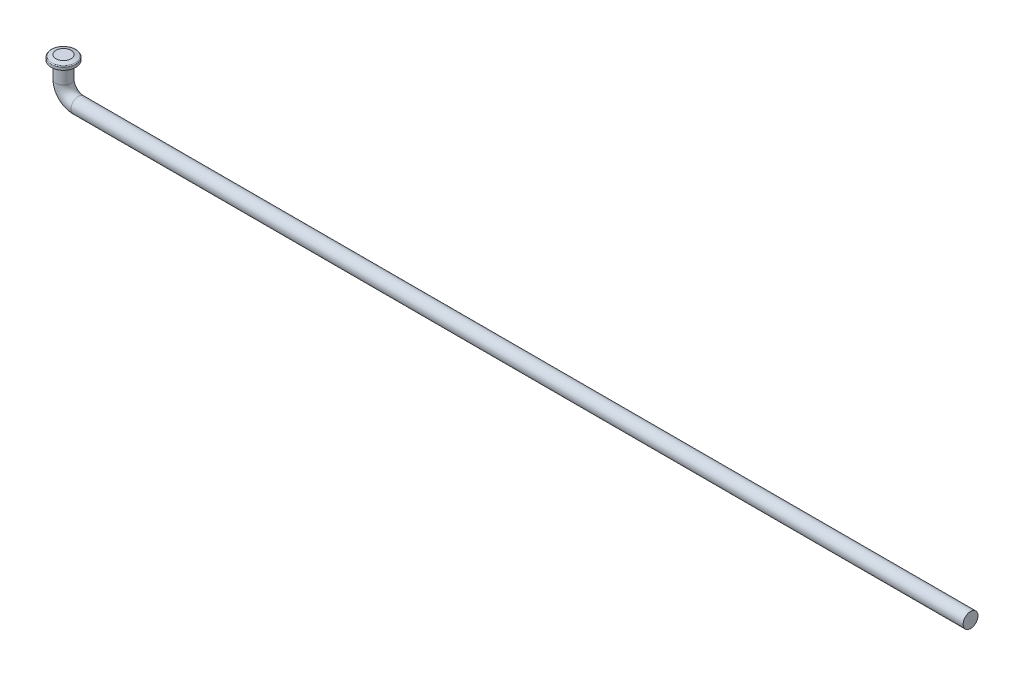
ISO-10303-21;
HEADER;
FILE_DESCRIPTION(('STEP AP214'),'2;1');
FILE_NAME('part.step','',(''),(''),'','','');
FILE_SCHEMA(('AUTOMOTIVE_DESIGN { 1 0 10303 214 1 1 1 1 }'));
ENDSEC;
DATA;
#1=APPLICATION_CONTEXT('core data for automotive mechanical design processes');
#2=APPLICATION_PROTOCOL_DEFINITION('international standard','automotive_design',2000,#1);
#3=PRODUCT_CONTEXT('',#1,'mechanical');
#4=PRODUCT('Part','Part','',(#3));
#5=PRODUCT_RELATED_PRODUCT_CATEGORY('part','',(#4));
#6=PRODUCT_DEFINITION_FORMATION('','',#4);
#7=PRODUCT_DEFINITION_CONTEXT('part definition',#1,'design');
#8=PRODUCT_DEFINITION('design','',#6,#7);
#9=PRODUCT_DEFINITION_SHAPE('','',#8);
#10=(LENGTH_UNIT() NAMED_UNIT(*) SI_UNIT(.MILLI.,.METRE.));
#11=(NAMED_UNIT(*) PLANE_ANGLE_UNIT() SI_UNIT($,.RADIAN.));
#12=(NAMED_UNIT(*) SI_UNIT($,.STERADIAN.) SOLID_ANGLE_UNIT());
#13=UNCERTAINTY_MEASURE_WITH_UNIT(LENGTH_MEASURE(1.E-05),#10,'distance_accuracy_value','');
#14=(GEOMETRIC_REPRESENTATION_CONTEXT(3) GLOBAL_UNCERTAINTY_ASSIGNED_CONTEXT((#13)) GLOBAL_UNIT_ASSIGNED_CONTEXT((#10,
#11,#12)) REPRESENTATION_CONTEXT('',''));
#15=CARTESIAN_POINT('',(0.,0.,0.));
#16=DIRECTION('',(0.,0.,1.));
#17=DIRECTION('',(1.,0.,0.));
#18=AXIS2_PLACEMENT_3D('',#15,#16,#17);
#19=CARTESIAN_POINT('',(-93.,6.85119386982182,0.));
#20=DIRECTION('',(0.,1.,0.));
#21=DIRECTION('',(-1.,0.,0.));
#22=AXIS2_PLACEMENT_3D('',#19,#20,#21);
#23=TOROIDAL_SURFACE('',#22,2.3,0.2);
#24=CARTESIAN_POINT('',(-93.,6.85119386982182,0.));
#25=DIRECTION('',(0.,1.,0.));
#26=DIRECTION('',(-1.,0.,0.));
#27=AXIS2_PLACEMENT_3D('',#24,#25,#26);
#28=CIRCLE('',#27,2.5);
#29=CARTESIAN_POINT('',(-95.5,6.85119386982182,0.));
#30=VERTEX_POINT('',#29);
#31=EDGE_CURVE('E53',#30,#30,#28,.F.);
#32=ORIENTED_EDGE('',*,*,#31,.F.);
#33=EDGE_LOOP('',(#32));
#34=FACE_BOUND('',#33,.T.);
#35=CARTESIAN_POINT('',(-93.,7.04275912686605,0.));
#36=DIRECTION('',(0.,-1.,0.));
#37=DIRECTION('',(0.,0.,-1.));
#38=AXIS2_PLACEMENT_3D('',#35,#36,#37);
#39=CIRCLE('',#38,2.35746957711326);
#40=CARTESIAN_POINT('',(-93.,7.04275912686605,-2.35746957711326));
#41=VERTEX_POINT('',#40);
#42=EDGE_CURVE('E12',#41,#41,#39,.F.);
#43=ORIENTED_EDGE('',*,*,#42,.F.);
#44=EDGE_LOOP('',(#43));
#45=FACE_BOUND('',#44,.T.);
#46=ADVANCED_FACE('F47',(#34,#45),#23,.T.);
#47=CARTESIAN_POINT('',(-93.,7.30000000000002,0.));
#48=DIRECTION('',(0.,-1.,0.));
#49=DIRECTION('',(1.,0.,0.));
#50=AXIS2_PLACEMENT_3D('',#47,#48,#49);
#51=CYLINDRICAL_SURFACE('',#50,2.5);
#52=ORIENTED_EDGE('',*,*,#31,.T.);
#53=EDGE_LOOP('',(#52));
#54=FACE_BOUND('',#53,.T.);
#55=CARTESIAN_POINT('',(-93.,6.30000000000002,0.));
#56=DIRECTION('',(0.,1.,0.));
#57=DIRECTION('',(0.,0.,1.));
#58=AXIS2_PLACEMENT_3D('',#55,#56,#57);
#59=CIRCLE('',#58,2.5);
#60=CARTESIAN_POINT('',(-93.,6.30000000000002,2.5));
#61=VERTEX_POINT('',#60);
#62=EDGE_CURVE('E61',#61,#61,#59,.T.);
#63=ORIENTED_EDGE('',*,*,#62,.T.);
#64=EDGE_LOOP('',(#63));
#65=FACE_BOUND('',#64,.T.);
#66=ADVANCED_FACE('F86',(#54,#65),#51,.T.);
#67=CARTESIAN_POINT('',(-93.,7.30000000000002,0.));
#68=DIRECTION('',(0.,1.,0.));
#69=DIRECTION('',(-1.,0.,0.));
#70=AXIS2_PLACEMENT_3D('',#67,#68,#69);
#71=PLANE('',#70);
#72=CARTESIAN_POINT('',(-93.,7.30000000000002,0.));
#73=DIRECTION('',(0.,1.,0.));
#74=DIRECTION('',(-1.,0.,0.));
#75=AXIS2_PLACEMENT_3D('',#72,#73,#74);
#76=CIRCLE('',#75,1.5);
#77=CARTESIAN_POINT('',(-94.5,7.30000000000002,0.));
#78=VERTEX_POINT('',#77);
#79=EDGE_CURVE('E66',#78,#78,#76,.T.);
#80=ORIENTED_EDGE('',*,*,#79,.T.);
#81=EDGE_LOOP('',(#80));
#82=FACE_BOUND('',#81,.T.);
#83=ADVANCED_FACE('F70',(#82),#71,.T.);
#84=CARTESIAN_POINT('',(-93.,6.00000000000002,0.));
#85=DIRECTION('',(0.,1.,0.));
#86=DIRECTION('',(-1.,0.,0.));
#87=AXIS2_PLACEMENT_3D('',#84,#85,#86);
#88=PLANE('',#87);
#89=CARTESIAN_POINT('',(-93.,6.00000000000002,0.));
#90=DIRECTION('',(0.,1.,0.));
#91=DIRECTION('',(-1.,0.,0.));
#92=AXIS2_PLACEMENT_3D('',#89,#90,#91);
#93=CIRCLE('',#92,1.71847328059185);
#94=CARTESIAN_POINT('',(-94.7184732805919,6.00000000000002,0.));
#95=VERTEX_POINT('',#94);
#96=EDGE_CURVE('E57',#95,#95,#93,.F.);
#97=ORIENTED_EDGE('',*,*,#96,.T.);
#98=EDGE_LOOP('',(#97));
#99=FACE_BOUND('',#98,.T.);
#100=ADVANCED_FACE('F75',(#99),#88,.F.);
#101=CARTESIAN_POINT('',(-93.,7.30000000000002,0.));
#102=DIRECTION('',(0.,-1.,0.));
#103=DIRECTION('',(0.,0.,-1.));
#104=AXIS2_PLACEMENT_3D('',#101,#102,#103);
#105=CONICAL_SURFACE('',#104,1.5,1.27933953231703);
#106=ORIENTED_EDGE('',*,*,#42,.T.);
#107=EDGE_LOOP('',(#106));
#108=FACE_BOUND('',#107,.T.);
#109=ORIENTED_EDGE('',*,*,#79,.F.);
#110=EDGE_LOOP('',(#109));
#111=FACE_BOUND('',#110,.T.);
#112=ADVANCED_FACE('F72',(#108,#111),#105,.T.);
#113=CARTESIAN_POINT('',(-93.,6.30000000000002,0.));
#114=DIRECTION('',(0.,1.,0.));
#115=DIRECTION('',(0.,0.,1.));
#116=AXIS2_PLACEMENT_3D('',#113,#114,#115);
#117=CONICAL_SURFACE('',#116,2.5,1.20427718387609);
#118=ORIENTED_EDGE('',*,*,#96,.F.);
#119=EDGE_LOOP('',(#118));
#120=FACE_BOUND('',#119,.T.);
#121=ORIENTED_EDGE('',*,*,#62,.F.);
#122=EDGE_LOOP('',(#121));
#123=FACE_BOUND('',#122,.T.);
#124=ADVANCED_FACE('F74',(#120,#123),#117,.T.);
#125=CLOSED_SHELL('',(#46,#66,#83,#100,#112,#124));
#126=MANIFOLD_SOLID_BREP('B2',#125);
#127=CARTESIAN_POINT('',(-93.,3.00000000000001,0.));
#128=DIRECTION('',(0.,1.,0.));
#129=DIRECTION('',(0.,0.,1.));
#130=AXIS2_PLACEMENT_3D('',#127,#128,#129);
#131=CYLINDRICAL_SURFACE('',#130,1.5);
#132=CARTESIAN_POINT('',(-93.,6.00000000000001,0.));
#133=DIRECTION('',(0.,-1.,0.));
#134=DIRECTION('',(1.,0.,0.));
#135=AXIS2_PLACEMENT_3D('',#132,#133,#134);
#136=CIRCLE('',#135,1.5);
#137=CARTESIAN_POINT('',(-91.5,6.00000000000001,0.));
#138=VERTEX_POINT('',#137);
#139=EDGE_CURVE('E138',#138,#138,#136,.T.);
#140=ORIENTED_EDGE('',*,*,#139,.T.);
#141=EDGE_LOOP('',(#140));
#142=FACE_BOUND('',#141,.T.);
#143=CARTESIAN_POINT('',(-93.,3.,0.));
#144=DIRECTION('',(0.,-1.,0.));
#145=DIRECTION('',(1.,0.,0.));
#146=AXIS2_PLACEMENT_3D('',#143,#144,#145);
#147=CIRCLE('',#146,1.5);
#148=CARTESIAN_POINT('',(-94.5,3.,0.));
#149=VERTEX_POINT('',#148);
#150=EDGE_CURVE('E46',#149,#149,#147,.T.);
#151=ORIENTED_EDGE('',*,*,#150,.F.);
#152=EDGE_LOOP('',(#151));
#153=FACE_BOUND('',#152,.T.);
#154=ADVANCED_FACE('F132',(#142,#153),#131,.T.);
#155=CARTESIAN_POINT('',(-93.,6.00000000000001,0.));
#156=DIRECTION('',(0.,-1.,0.));
#157=DIRECTION('',(1.,0.,0.));
#158=AXIS2_PLACEMENT_3D('',#155,#156,#157);
#159=PLANE('',#158);
#160=ORIENTED_EDGE('',*,*,#139,.F.);
#161=EDGE_LOOP('',(#160));
#162=FACE_BOUND('',#161,.T.);
#163=ADVANCED_FACE('F162',(#162),#159,.F.);
#164=CARTESIAN_POINT('',(-90.,3.,0.));
#165=DIRECTION('',(0.,0.,-1.));
#166=DIRECTION('',(-1.,0.,0.));
#167=AXIS2_PLACEMENT_3D('',#164,#165,#166);
#168=TOROIDAL_SURFACE('',#167,3.,1.5);
#169=CARTESIAN_POINT('',(-90.,0.,0.));
#170=DIRECTION('',(1.,0.,0.));
#171=DIRECTION('',(0.,1.,0.));
#172=AXIS2_PLACEMENT_3D('',#169,#170,#171);
#173=CIRCLE('',#172,1.5);
#174=CARTESIAN_POINT('',(-90.,-1.5,0.));
#175=VERTEX_POINT('',#174);
#176=EDGE_CURVE('E142',#175,#175,#173,.T.);
#177=CARTESIAN_POINT('',(-90.,3.,0.));
#178=DIRECTION('',(0.,0.,-1.));
#179=DIRECTION('',(-1.,0.,0.));
#180=AXIS2_PLACEMENT_3D('',#177,#178,#179);
#181=CIRCLE('',#180,4.5);
#182=EDGE_CURVE('',#175,#149,#181,.T.);
#183=ORIENTED_EDGE('',*,*,#176,.F.);
#184=ORIENTED_EDGE('',*,*,#150,.T.);
#185=ORIENTED_EDGE('',*,*,#182,.T.);
#186=ORIENTED_EDGE('',*,*,#182,.F.);
#187=EDGE_LOOP('',(#183,#185,#184,#186));
#188=FACE_BOUND('',#187,.T.);
#189=ADVANCED_FACE('F157',(#188),#168,.T.);
#190=CARTESIAN_POINT('',(90.,0.,0.));
#191=DIRECTION('',(-1.,0.,0.));
#192=DIRECTION('',(0.,-1.,0.));
#193=AXIS2_PLACEMENT_3D('',#190,#191,#192);
#194=CYLINDRICAL_SURFACE('',#193,1.5);
#195=CARTESIAN_POINT('',(90.,0.,0.));
#196=DIRECTION('',(1.,0.,0.));
#197=DIRECTION('',(0.,1.,0.));
#198=AXIS2_PLACEMENT_3D('',#195,#196,#197);
#199=CIRCLE('',#198,1.5);
#200=CARTESIAN_POINT('',(90.,-1.49999999999997,0.));
#201=VERTEX_POINT('',#200);
#202=EDGE_CURVE('E146',#201,#201,#199,.T.);
#203=CARTESIAN_POINT('',(90.,-1.49999999999997,0.));
#204=CARTESIAN_POINT('',(88.125,-1.49999999999997,0.));
#205=CARTESIAN_POINT('',(86.25,-1.49999999999997,0.));
#206=CARTESIAN_POINT('',(82.5,-1.49999999999997,0.));
#207=CARTESIAN_POINT('',(80.625,-1.49999999999997,0.));
#208=CARTESIAN_POINT('',(76.875,-1.49999999999997,0.));
#209=CARTESIAN_POINT('',(75.,-1.49999999999997,0.));
#210=CARTESIAN_POINT('',(71.25,-1.49999999999997,0.));
#211=CARTESIAN_POINT('',(69.375,-1.49999999999997,0.));
#212=CARTESIAN_POINT('',(65.625,-1.49999999999997,0.));
#213=CARTESIAN_POINT('',(63.75,-1.49999999999997,0.));
#214=CARTESIAN_POINT('',(60.,-1.49999999999997,0.));
#215=CARTESIAN_POINT('',(58.125,-1.49999999999997,0.));
#216=CARTESIAN_POINT('',(54.375,-1.49999999999997,0.));
#217=CARTESIAN_POINT('',(52.5,-1.49999999999997,0.));
#218=CARTESIAN_POINT('',(48.75,-1.49999999999997,0.));
#219=CARTESIAN_POINT('',(46.875,-1.49999999999998,0.));
#220=CARTESIAN_POINT('',(43.125,-1.49999999999998,0.));
#221=CARTESIAN_POINT('',(41.25,-1.49999999999998,0.));
#222=CARTESIAN_POINT('',(37.5,-1.49999999999998,0.));
#223=CARTESIAN_POINT('',(35.625,-1.49999999999998,0.));
#224=CARTESIAN_POINT('',(31.875,-1.49999999999998,0.));
#225=CARTESIAN_POINT('',(30.,-1.49999999999998,0.));
#226=CARTESIAN_POINT('',(26.25,-1.49999999999998,0.));
#227=CARTESIAN_POINT('',(24.375,-1.49999999999998,0.));
#228=CARTESIAN_POINT('',(20.625,-1.49999999999998,0.));
#229=CARTESIAN_POINT('',(18.75,-1.49999999999998,0.));
#230=CARTESIAN_POINT('',(15.,-1.49999999999998,0.));
#231=CARTESIAN_POINT('',(13.125,-1.49999999999998,0.));
#232=CARTESIAN_POINT('',(9.37500000000003,-1.49999999999998,0.));
#233=CARTESIAN_POINT('',(7.50000000000003,-1.49999999999998,0.));
#234=CARTESIAN_POINT('',(3.75000000000003,-1.49999999999998,0.));
#235=CARTESIAN_POINT('',(1.87500000000003,-1.49999999999998,0.));
#236=CARTESIAN_POINT('',(-1.87499999999997,-1.49999999999998,0.));
#237=CARTESIAN_POINT('',(-3.74999999999998,-1.49999999999998,0.));
#238=CARTESIAN_POINT('',(-7.49999999999997,-1.49999999999999,0.));
#239=CARTESIAN_POINT('',(-9.37499999999997,-1.49999999999999,0.));
#240=CARTESIAN_POINT('',(-13.125,-1.49999999999999,0.));
#241=CARTESIAN_POINT('',(-15.,-1.49999999999999,0.));
#242=CARTESIAN_POINT('',(-18.75,-1.49999999999999,0.));
#243=CARTESIAN_POINT('',(-20.625,-1.49999999999999,0.));
#244=CARTESIAN_POINT('',(-24.375,-1.49999999999999,0.));
#245=CARTESIAN_POINT('',(-26.25,-1.49999999999999,0.));
#246=CARTESIAN_POINT('',(-30.,-1.49999999999999,0.));
#247=CARTESIAN_POINT('',(-31.875,-1.49999999999999,0.));
#248=CARTESIAN_POINT('',(-35.625,-1.49999999999999,0.));
#249=CARTESIAN_POINT('',(-37.5,-1.49999999999999,0.));
#250=CARTESIAN_POINT('',(-41.25,-1.49999999999999,0.));
#251=CARTESIAN_POINT('',(-43.125,-1.49999999999999,0.));
#252=CARTESIAN_POINT('',(-46.875,-1.49999999999999,0.));
#253=CARTESIAN_POINT('',(-48.75,-1.49999999999999,0.));
#254=CARTESIAN_POINT('',(-52.5,-1.49999999999999,0.));
#255=CARTESIAN_POINT('',(-54.375,-1.49999999999999,0.));
#256=CARTESIAN_POINT('',(-58.125,-1.49999999999999,0.));
#257=CARTESIAN_POINT('',(-60.,-1.5,0.));
#258=CARTESIAN_POINT('',(-63.75,-1.5,0.));
#259=CARTESIAN_POINT('',(-65.625,-1.5,0.));
#260=CARTESIAN_POINT('',(-69.375,-1.5,0.));
#261=CARTESIAN_POINT('',(-71.25,-1.5,0.));
#262=CARTESIAN_POINT('',(-75.,-1.5,0.));
#263=CARTESIAN_POINT('',(-76.875,-1.5,0.));
#264=CARTESIAN_POINT('',(-80.625,-1.5,0.));
#265=CARTESIAN_POINT('',(-82.5,-1.5,0.));
#266=CARTESIAN_POINT('',(-86.25,-1.5,0.));
#267=CARTESIAN_POINT('',(-88.125,-1.5,0.));
#268=CARTESIAN_POINT('',(-90.,-1.5,0.));
#269=B_SPLINE_CURVE_WITH_KNOTS('',3,(#203,#204,#205,#206,#207,#208,#209,#210,#211,#212,#213,
#214,#215,#216,#217,#218,#219,#220,#221,#222,#223,#224,#225,#226,#227,#228,#229,#230,#231,#232,
#233,#234,#235,#236,#237,#238,#239,#240,#241,#242,#243,#244,#245,#246,#247,#248,#249,#250,#251,
#252,#253,#254,#255,#256,#257,#258,#259,#260,#261,#262,#263,#264,#265,#266,#267,#268),
.UNSPECIFIED.,.F.,.F.,(4,2,2,2,2,2,2,2,2,2,2,2,2,2,2,2,2,2,2,2,2,2,2,2,2,2,2,2,2,2,2,2,4),(0.,
5.62500000000001,11.25,16.875,22.5,28.125,33.75,39.375,45.,50.625,56.25,61.875,67.5,73.125,
78.75,84.375,90.,95.625,101.25,106.875,112.5,118.125,123.75,129.375,135.,140.625,146.25,151.875,
157.5,163.125,168.75,174.375,180.),.UNSPECIFIED.);
#270=EDGE_CURVE('BSEAM154',#201,#175,#269,.T.);
#271=ORIENTED_EDGE('',*,*,#202,.F.);
#272=ORIENTED_EDGE('',*,*,#176,.T.);
#273=ORIENTED_EDGE('',*,*,#270,.T.);
#274=ORIENTED_EDGE('',*,*,#270,.F.);
#275=EDGE_LOOP('',(#271,#273,#272,#274));
#276=FACE_BOUND('',#275,.T.);
#277=ADVANCED_FACE('F154',(#276),#194,.T.);
#278=CARTESIAN_POINT('',(90.,0.,0.));
#279=DIRECTION('',(1.,0.,0.));
#280=DIRECTION('',(0.,1.,0.));
#281=AXIS2_PLACEMENT_3D('',#278,#279,#280);
#282=PLANE('',#281);
#283=ORIENTED_EDGE('',*,*,#202,.T.);
#284=EDGE_LOOP('',(#283));
#285=FACE_BOUND('',#284,.T.);
#286=ADVANCED_FACE('F152',(#285),#282,.T.);
#287=CLOSED_SHELL('',(#154,#163,#189,#277,#286));
#288=MANIFOLD_SOLID_BREP('B7',#287);
#289=ADVANCED_BREP_SHAPE_REPRESENTATION('',(#18,#126,#288),#14);
#290=SHAPE_DEFINITION_REPRESENTATION(#9,#289);
ENDSEC;
END-ISO-10303-21;
